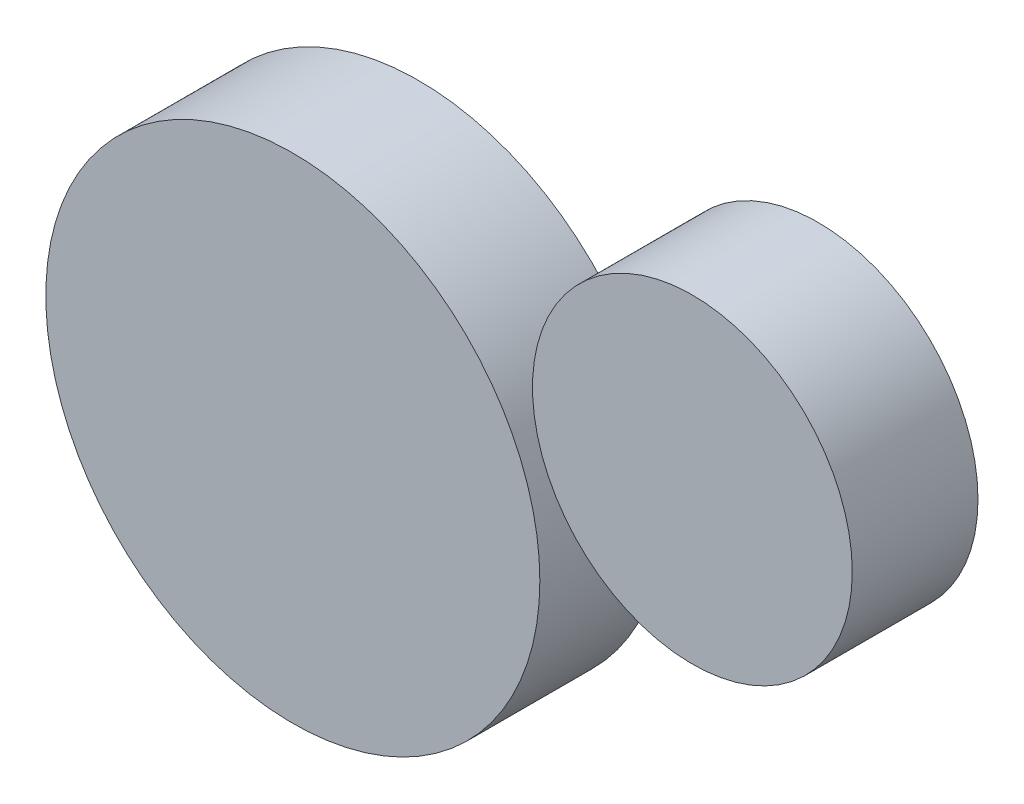
ISO-10303-21;
HEADER;
FILE_DESCRIPTION(('STEP AP214'),'2;1');
FILE_NAME('part.step','',(''),(''),'','','');
FILE_SCHEMA(('AUTOMOTIVE_DESIGN { 1 0 10303 214 1 1 1 1 }'));
ENDSEC;
DATA;
#1=APPLICATION_CONTEXT('core data for automotive mechanical design processes');
#2=APPLICATION_PROTOCOL_DEFINITION('international standard','automotive_design',2000,#1);
#3=PRODUCT_CONTEXT('',#1,'mechanical');
#4=PRODUCT('Part','Part','',(#3));
#5=PRODUCT_RELATED_PRODUCT_CATEGORY('part','',(#4));
#6=PRODUCT_DEFINITION_FORMATION('','',#4);
#7=PRODUCT_DEFINITION_CONTEXT('part definition',#1,'design');
#8=PRODUCT_DEFINITION('design','',#6,#7);
#9=PRODUCT_DEFINITION_SHAPE('','',#8);
#10=(LENGTH_UNIT() NAMED_UNIT(*) SI_UNIT(.MILLI.,.METRE.));
#11=(NAMED_UNIT(*) PLANE_ANGLE_UNIT() SI_UNIT($,.RADIAN.));
#12=(NAMED_UNIT(*) SI_UNIT($,.STERADIAN.) SOLID_ANGLE_UNIT());
#13=UNCERTAINTY_MEASURE_WITH_UNIT(LENGTH_MEASURE(1.E-05),#10,'distance_accuracy_value','');
#14=(GEOMETRIC_REPRESENTATION_CONTEXT(3) GLOBAL_UNCERTAINTY_ASSIGNED_CONTEXT((#13)) GLOBAL_UNIT_ASSIGNED_CONTEXT((#10,
#11,#12)) REPRESENTATION_CONTEXT('',''));
#15=CARTESIAN_POINT('',(0.,0.,0.));
#16=DIRECTION('',(0.,0.,1.));
#17=DIRECTION('',(1.,0.,0.));
#18=AXIS2_PLACEMENT_3D('',#15,#16,#17);
#19=CARTESIAN_POINT('',(-137.279468732706,52.2539331172425,30.));
#20=DIRECTION('',(0.,0.,-1.));
#21=DIRECTION('',(-1.,0.,0.));
#22=AXIS2_PLACEMENT_3D('',#19,#20,#21);
#23=CYLINDRICAL_SURFACE('',#22,58.9374138949281);
#24=CARTESIAN_POINT('',(-137.279468732706,52.2539331172425,30.));
#25=DIRECTION('',(0.,0.,1.));
#26=DIRECTION('',(1.,0.,0.));
#27=AXIS2_PLACEMENT_3D('',#24,#25,#26);
#28=CIRCLE('',#27,58.9374138949281);
#29=CARTESIAN_POINT('',(-78.3420548377781,52.2539331172425,30.));
#30=VERTEX_POINT('',#29);
#31=EDGE_CURVE('E11',#30,#30,#28,.T.);
#32=ORIENTED_EDGE('',*,*,#31,.F.);
#33=EDGE_LOOP('',(#32));
#34=FACE_BOUND('',#33,.T.);
#35=CARTESIAN_POINT('',(-137.279468732706,52.2539331172425,0.));
#36=DIRECTION('',(0.,0.,1.));
#37=DIRECTION('',(1.,0.,0.));
#38=AXIS2_PLACEMENT_3D('',#35,#36,#37);
#39=CIRCLE('',#38,58.9374138949281);
#40=CARTESIAN_POINT('',(-78.3420548377781,52.2539331172425,0.));
#41=VERTEX_POINT('',#40);
#42=EDGE_CURVE('E53',#41,#41,#39,.T.);
#43=ORIENTED_EDGE('',*,*,#42,.T.);
#44=EDGE_LOOP('',(#43));
#45=FACE_BOUND('',#44,.T.);
#46=ADVANCED_FACE('F45',(#34,#45),#23,.T.);
#47=CARTESIAN_POINT('',(0.,0.,30.));
#48=DIRECTION('',(0.,0.,1.));
#49=DIRECTION('',(1.,0.,0.));
#50=AXIS2_PLACEMENT_3D('',#47,#48,#49);
#51=PLANE('',#50);
#52=ORIENTED_EDGE('',*,*,#31,.T.);
#53=EDGE_LOOP('',(#52));
#54=FACE_BOUND('',#53,.T.);
#55=ADVANCED_FACE('F66',(#54),#51,.T.);
#56=CARTESIAN_POINT('',(0.,0.,0.));
#57=DIRECTION('',(0.,0.,1.));
#58=DIRECTION('',(1.,0.,0.));
#59=AXIS2_PLACEMENT_3D('',#56,#57,#58);
#60=PLANE('',#59);
#61=ORIENTED_EDGE('',*,*,#42,.F.);
#62=EDGE_LOOP('',(#61));
#63=FACE_BOUND('',#62,.T.);
#64=ADVANCED_FACE('F64',(#63),#60,.F.);
#65=CLOSED_SHELL('',(#46,#55,#64));
#66=MANIFOLD_SOLID_BREP('B2',#65);
#67=CARTESIAN_POINT('',(-41.9514595673434,91.3744368454559,30.));
#68=DIRECTION('',(0.,0.,-1.));
#69=DIRECTION('',(-1.,0.,0.));
#70=AXIS2_PLACEMENT_3D('',#67,#68,#69);
#71=CYLINDRICAL_SURFACE('',#70,38.147839003839);
#72=CARTESIAN_POINT('',(-41.9514595673434,91.3744368454559,30.));
#73=DIRECTION('',(0.,0.,1.));
#74=DIRECTION('',(1.,0.,0.));
#75=AXIS2_PLACEMENT_3D('',#72,#73,#74);
#76=CIRCLE('',#75,38.147839003839);
#77=CARTESIAN_POINT('',(-3.80362056350437,91.3744368454559,30.));
#78=VERTEX_POINT('',#77);
#79=EDGE_CURVE('E44',#78,#78,#76,.T.);
#80=ORIENTED_EDGE('',*,*,#79,.F.);
#81=EDGE_LOOP('',(#80));
#82=FACE_BOUND('',#81,.T.);
#83=CARTESIAN_POINT('',(-41.9514595673434,91.3744368454559,0.));
#84=DIRECTION('',(0.,0.,1.));
#85=DIRECTION('',(1.,0.,0.));
#86=AXIS2_PLACEMENT_3D('',#83,#84,#85);
#87=CIRCLE('',#86,38.147839003839);
#88=CARTESIAN_POINT('',(-3.80362056350437,91.3744368454559,0.));
#89=VERTEX_POINT('',#88);
#90=EDGE_CURVE('E99',#89,#89,#87,.T.);
#91=ORIENTED_EDGE('',*,*,#90,.T.);
#92=EDGE_LOOP('',(#91));
#93=FACE_BOUND('',#92,.T.);
#94=ADVANCED_FACE('F92',(#82,#93),#71,.T.);
#95=CARTESIAN_POINT('',(0.,0.,30.));
#96=DIRECTION('',(0.,0.,1.));
#97=DIRECTION('',(1.,0.,0.));
#98=AXIS2_PLACEMENT_3D('',#95,#96,#97);
#99=PLANE('',#98);
#100=ORIENTED_EDGE('',*,*,#79,.T.);
#101=EDGE_LOOP('',(#100));
#102=FACE_BOUND('',#101,.T.);
#103=ADVANCED_FACE('F111',(#102),#99,.T.);
#104=CARTESIAN_POINT('',(0.,0.,0.));
#105=DIRECTION('',(0.,0.,1.));
#106=DIRECTION('',(1.,0.,0.));
#107=AXIS2_PLACEMENT_3D('',#104,#105,#106);
#108=PLANE('',#107);
#109=ORIENTED_EDGE('',*,*,#90,.F.);
#110=EDGE_LOOP('',(#109));
#111=FACE_BOUND('',#110,.T.);
#112=ADVANCED_FACE('F109',(#111),#108,.F.);
#113=CLOSED_SHELL('',(#94,#103,#112));
#114=MANIFOLD_SOLID_BREP('B6',#113);
#115=ADVANCED_BREP_SHAPE_REPRESENTATION('',(#18,#66,#114),#14);
#116=SHAPE_DEFINITION_REPRESENTATION(#9,#115);
ENDSEC;
END-ISO-10303-21;
